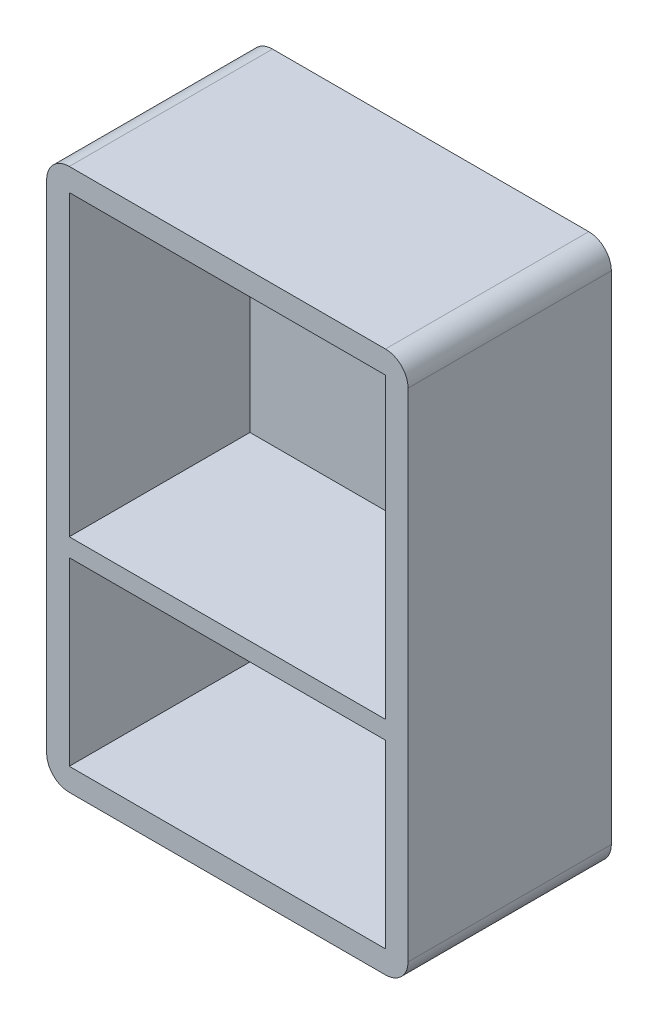
ISO-10303-21;
HEADER;
FILE_DESCRIPTION(('STEP AP214'),'2;1');
FILE_NAME('part.step','',(''),(''),'','','');
FILE_SCHEMA(('AUTOMOTIVE_DESIGN { 1 0 10303 214 1 1 1 1 }'));
ENDSEC;
DATA;
#1=APPLICATION_CONTEXT('core data for automotive mechanical design processes');
#2=APPLICATION_PROTOCOL_DEFINITION('international standard','automotive_design',2000,#1);
#3=PRODUCT_CONTEXT('',#1,'mechanical');
#4=PRODUCT('Part','Part','',(#3));
#5=PRODUCT_RELATED_PRODUCT_CATEGORY('part','',(#4));
#6=PRODUCT_DEFINITION_FORMATION('','',#4);
#7=PRODUCT_DEFINITION_CONTEXT('part definition',#1,'design');
#8=PRODUCT_DEFINITION('design','',#6,#7);
#9=PRODUCT_DEFINITION_SHAPE('','',#8);
#10=(LENGTH_UNIT() NAMED_UNIT(*) SI_UNIT(.MILLI.,.METRE.));
#11=(NAMED_UNIT(*) PLANE_ANGLE_UNIT() SI_UNIT($,.RADIAN.));
#12=(NAMED_UNIT(*) SI_UNIT($,.STERADIAN.) SOLID_ANGLE_UNIT());
#13=UNCERTAINTY_MEASURE_WITH_UNIT(LENGTH_MEASURE(1.E-05),#10,'distance_accuracy_value','');
#14=(GEOMETRIC_REPRESENTATION_CONTEXT(3) GLOBAL_UNCERTAINTY_ASSIGNED_CONTEXT((#13)) GLOBAL_UNIT_ASSIGNED_CONTEXT((#10,
#11,#12)) REPRESENTATION_CONTEXT('',''));
#15=CARTESIAN_POINT('',(0.,0.,0.));
#16=DIRECTION('',(0.,0.,1.));
#17=DIRECTION('',(1.,0.,0.));
#18=AXIS2_PLACEMENT_3D('',#15,#16,#17);
#19=CARTESIAN_POINT('',(40.,60.,5.));
#20=DIRECTION('',(-1.,0.,0.));
#21=DIRECTION('',(0.,-1.,0.));
#22=AXIS2_PLACEMENT_3D('',#19,#20,#21);
#23=PLANE('',#22);
#24=DIRECTION('',(0.,1.,0.));
#25=VECTOR('',#24,1.);
#26=CARTESIAN_POINT('',(40.,-60.,45.));
#27=LINE('',#26,#25);
#28=CARTESIAN_POINT('',(40.,-55.,45.));
#29=VERTEX_POINT('',#28);
#30=CARTESIAN_POINT('',(40.,55.,45.));
#31=VERTEX_POINT('',#30);
#32=EDGE_CURVE('E219',#29,#31,#27,.T.);
#33=ORIENTED_EDGE('',*,*,#32,.F.);
#34=DIRECTION('',(0.,0.,-1.));
#35=VECTOR('',#34,1.);
#36=CARTESIAN_POINT('',(40.,-55.,5.));
#37=LINE('',#36,#35);
#38=CARTESIAN_POINT('',(40.,-55.,0.));
#39=VERTEX_POINT('',#38);
#40=EDGE_CURVE('E267',#29,#39,#37,.T.);
#41=ORIENTED_EDGE('',*,*,#40,.T.);
#42=DIRECTION('',(0.,1.,0.));
#43=VECTOR('',#42,1.);
#44=CARTESIAN_POINT('',(40.,60.,0.));
#45=LINE('',#44,#43);
#46=CARTESIAN_POINT('',(40.,55.,0.));
#47=VERTEX_POINT('',#46);
#48=EDGE_CURVE('E229',#39,#47,#45,.T.);
#49=ORIENTED_EDGE('',*,*,#48,.T.);
#50=DIRECTION('',(0.,0.,-1.));
#51=VECTOR('',#50,1.);
#52=CARTESIAN_POINT('',(40.,55.,5.));
#53=LINE('',#52,#51);
#54=EDGE_CURVE('E265',#47,#31,#53,.F.);
#55=ORIENTED_EDGE('',*,*,#54,.T.);
#56=EDGE_LOOP('',(#33,#41,#49,#55));
#57=FACE_BOUND('',#56,.T.);
#58=ADVANCED_FACE('F34',(#57),#23,.F.);
#59=CARTESIAN_POINT('',(-40.,60.,5.));
#60=DIRECTION('',(0.,-1.,0.));
#61=DIRECTION('',(0.,0.,-1.));
#62=AXIS2_PLACEMENT_3D('',#59,#60,#61);
#63=PLANE('',#62);
#64=DIRECTION('',(-1.,0.,0.));
#65=VECTOR('',#64,1.);
#66=CARTESIAN_POINT('',(-40.,60.,45.));
#67=LINE('',#66,#65);
#68=CARTESIAN_POINT('',(35.,60.,45.));
#69=VERTEX_POINT('',#68);
#70=CARTESIAN_POINT('',(-35.,60.,45.));
#71=VERTEX_POINT('',#70);
#72=EDGE_CURVE('E221',#69,#71,#67,.T.);
#73=ORIENTED_EDGE('',*,*,#72,.F.);
#74=DIRECTION('',(0.,0.,-1.));
#75=VECTOR('',#74,1.);
#76=CARTESIAN_POINT('',(35.,60.,5.));
#77=LINE('',#76,#75);
#78=CARTESIAN_POINT('',(35.,60.,0.));
#79=VERTEX_POINT('',#78);
#80=EDGE_CURVE('E11',#69,#79,#77,.T.);
#81=ORIENTED_EDGE('',*,*,#80,.T.);
#82=DIRECTION('',(-1.,0.,0.));
#83=VECTOR('',#82,1.);
#84=CARTESIAN_POINT('',(-40.,60.,0.));
#85=LINE('',#84,#83);
#86=CARTESIAN_POINT('',(-35.,60.,0.));
#87=VERTEX_POINT('',#86);
#88=EDGE_CURVE('E232',#79,#87,#85,.T.);
#89=ORIENTED_EDGE('',*,*,#88,.T.);
#90=DIRECTION('',(0.,0.,-1.));
#91=VECTOR('',#90,1.);
#92=CARTESIAN_POINT('',(-35.,60.,5.));
#93=LINE('',#92,#91);
#94=EDGE_CURVE('E42',#87,#71,#93,.F.);
#95=ORIENTED_EDGE('',*,*,#94,.T.);
#96=EDGE_LOOP('',(#73,#81,#89,#95));
#97=FACE_BOUND('',#96,.T.);
#98=ADVANCED_FACE('F283',(#97),#63,.F.);
#99=CARTESIAN_POINT('',(-40.,60.,5.));
#100=DIRECTION('',(1.,0.,0.));
#101=DIRECTION('',(0.,1.,0.));
#102=AXIS2_PLACEMENT_3D('',#99,#100,#101);
#103=PLANE('',#102);
#104=DIRECTION('',(0.,-1.,0.));
#105=VECTOR('',#104,1.);
#106=CARTESIAN_POINT('',(-40.,60.,0.));
#107=LINE('',#106,#105);
#108=CARTESIAN_POINT('',(-40.,55.,0.));
#109=VERTEX_POINT('',#108);
#110=CARTESIAN_POINT('',(-40.,-55.,0.));
#111=VERTEX_POINT('',#110);
#112=EDGE_CURVE('E234',#109,#111,#107,.T.);
#113=ORIENTED_EDGE('',*,*,#112,.T.);
#114=DIRECTION('',(0.,0.,-1.));
#115=VECTOR('',#114,1.);
#116=CARTESIAN_POINT('',(-40.,-55.,5.));
#117=LINE('',#116,#115);
#118=CARTESIAN_POINT('',(-40.,-55.,45.));
#119=VERTEX_POINT('',#118);
#120=EDGE_CURVE('E256',#111,#119,#117,.F.);
#121=ORIENTED_EDGE('',*,*,#120,.T.);
#122=DIRECTION('',(0.,-1.,0.));
#123=VECTOR('',#122,1.);
#124=CARTESIAN_POINT('',(-40.,-60.,45.));
#125=LINE('',#124,#123);
#126=CARTESIAN_POINT('',(-40.,55.,45.));
#127=VERTEX_POINT('',#126);
#128=EDGE_CURVE('E223',#127,#119,#125,.T.);
#129=ORIENTED_EDGE('',*,*,#128,.F.);
#130=DIRECTION('',(0.,0.,-1.));
#131=VECTOR('',#130,1.);
#132=CARTESIAN_POINT('',(-40.,55.,5.));
#133=LINE('',#132,#131);
#134=EDGE_CURVE('E253',#127,#109,#133,.T.);
#135=ORIENTED_EDGE('',*,*,#134,.T.);
#136=EDGE_LOOP('',(#113,#121,#129,#135));
#137=FACE_BOUND('',#136,.T.);
#138=ADVANCED_FACE('F290',(#137),#103,.F.);
#139=CARTESIAN_POINT('',(-40.,-60.,5.));
#140=DIRECTION('',(0.,1.,0.));
#141=DIRECTION('',(0.,0.,1.));
#142=AXIS2_PLACEMENT_3D('',#139,#140,#141);
#143=PLANE('',#142);
#144=DIRECTION('',(1.,0.,0.));
#145=VECTOR('',#144,1.);
#146=CARTESIAN_POINT('',(-40.,-60.,45.));
#147=LINE('',#146,#145);
#148=CARTESIAN_POINT('',(-35.,-60.,45.));
#149=VERTEX_POINT('',#148);
#150=CARTESIAN_POINT('',(35.,-60.,45.));
#151=VERTEX_POINT('',#150);
#152=EDGE_CURVE('E226',#149,#151,#147,.T.);
#153=ORIENTED_EDGE('',*,*,#152,.F.);
#154=DIRECTION('',(0.,0.,-1.));
#155=VECTOR('',#154,1.);
#156=CARTESIAN_POINT('',(-35.,-60.,5.));
#157=LINE('',#156,#155);
#158=CARTESIAN_POINT('',(-35.,-60.,0.));
#159=VERTEX_POINT('',#158);
#160=EDGE_CURVE('E242',#149,#159,#157,.T.);
#161=ORIENTED_EDGE('',*,*,#160,.T.);
#162=DIRECTION('',(1.,0.,0.));
#163=VECTOR('',#162,1.);
#164=CARTESIAN_POINT('',(-40.,-60.,0.));
#165=LINE('',#164,#163);
#166=CARTESIAN_POINT('',(35.,-60.,0.));
#167=VERTEX_POINT('',#166);
#168=EDGE_CURVE('E237',#159,#167,#165,.T.);
#169=ORIENTED_EDGE('',*,*,#168,.T.);
#170=DIRECTION('',(0.,0.,-1.));
#171=VECTOR('',#170,1.);
#172=CARTESIAN_POINT('',(35.,-60.,5.));
#173=LINE('',#172,#171);
#174=EDGE_CURVE('E240',#167,#151,#173,.F.);
#175=ORIENTED_EDGE('',*,*,#174,.T.);
#176=EDGE_LOOP('',(#153,#161,#169,#175));
#177=FACE_BOUND('',#176,.T.);
#178=ADVANCED_FACE('F298',(#177),#143,.F.);
#179=CARTESIAN_POINT('',(0.,0.,0.));
#180=DIRECTION('',(0.,0.,1.));
#181=DIRECTION('',(1.,0.,0.));
#182=AXIS2_PLACEMENT_3D('',#179,#180,#181);
#183=PLANE('',#182);
#184=ORIENTED_EDGE('',*,*,#168,.F.);
#185=CARTESIAN_POINT('',(-35.,-55.,0.));
#186=DIRECTION('',(0.,0.,1.));
#187=DIRECTION('',(1.,0.,0.));
#188=AXIS2_PLACEMENT_3D('',#185,#186,#187);
#189=CIRCLE('',#188,5.);
#190=EDGE_CURVE('E251',#159,#111,#189,.F.);
#191=ORIENTED_EDGE('',*,*,#190,.T.);
#192=ORIENTED_EDGE('',*,*,#112,.F.);
#193=CARTESIAN_POINT('',(-35.,55.,0.));
#194=DIRECTION('',(0.,0.,1.));
#195=DIRECTION('',(1.,0.,0.));
#196=AXIS2_PLACEMENT_3D('',#193,#194,#195);
#197=CIRCLE('',#196,5.);
#198=EDGE_CURVE('E245',#109,#87,#197,.F.);
#199=ORIENTED_EDGE('',*,*,#198,.T.);
#200=ORIENTED_EDGE('',*,*,#88,.F.);
#201=CARTESIAN_POINT('',(35.,55.,0.));
#202=DIRECTION('',(0.,0.,1.));
#203=DIRECTION('',(1.,0.,0.));
#204=AXIS2_PLACEMENT_3D('',#201,#202,#203);
#205=CIRCLE('',#204,5.);
#206=EDGE_CURVE('E247',#79,#47,#205,.F.);
#207=ORIENTED_EDGE('',*,*,#206,.T.);
#208=ORIENTED_EDGE('',*,*,#48,.F.);
#209=CARTESIAN_POINT('',(35.,-55.,0.));
#210=DIRECTION('',(0.,0.,1.));
#211=DIRECTION('',(1.,0.,0.));
#212=AXIS2_PLACEMENT_3D('',#209,#210,#211);
#213=CIRCLE('',#212,5.);
#214=EDGE_CURVE('E249',#39,#167,#213,.F.);
#215=ORIENTED_EDGE('',*,*,#214,.T.);
#216=EDGE_LOOP('',(#184,#191,#192,#199,#200,#207,#208,#215));
#217=FACE_BOUND('',#216,.T.);
#218=ADVANCED_FACE('F278',(#217),#183,.F.);
#219=CARTESIAN_POINT('',(0.,0.,45.));
#220=DIRECTION('',(0.,0.,-1.));
#221=DIRECTION('',(-1.,0.,0.));
#222=AXIS2_PLACEMENT_3D('',#219,#220,#221);
#223=PLANE('',#222);
#224=DIRECTION('',(0.,1.,0.));
#225=VECTOR('',#224,1.);
#226=CARTESIAN_POINT('',(35.,55.,45.));
#227=LINE('',#226,#225);
#228=CARTESIAN_POINT('',(35.,-11.,45.));
#229=VERTEX_POINT('',#228);
#230=CARTESIAN_POINT('',(35.,55.,45.));
#231=VERTEX_POINT('',#230);
#232=EDGE_CURVE('E191',#229,#231,#227,.T.);
#233=ORIENTED_EDGE('',*,*,#232,.F.);
#234=DIRECTION('',(1.,0.,0.));
#235=VECTOR('',#234,1.);
#236=CARTESIAN_POINT('',(-35.,-11.,45.));
#237=LINE('',#236,#235);
#238=CARTESIAN_POINT('',(-35.,-11.,45.));
#239=VERTEX_POINT('',#238);
#240=EDGE_CURVE('E199',#239,#229,#237,.T.);
#241=ORIENTED_EDGE('',*,*,#240,.F.);
#242=DIRECTION('',(0.,-1.,0.));
#243=VECTOR('',#242,1.);
#244=CARTESIAN_POINT('',(-35.,55.,45.));
#245=LINE('',#244,#243);
#246=CARTESIAN_POINT('',(-35.,55.,45.));
#247=VERTEX_POINT('',#246);
#248=EDGE_CURVE('E196',#247,#239,#245,.T.);
#249=ORIENTED_EDGE('',*,*,#248,.F.);
#250=DIRECTION('',(-1.,0.,0.));
#251=VECTOR('',#250,1.);
#252=CARTESIAN_POINT('',(-35.,55.,45.));
#253=LINE('',#252,#251);
#254=EDGE_CURVE('E193',#231,#247,#253,.T.);
#255=ORIENTED_EDGE('',*,*,#254,.F.);
#256=EDGE_LOOP('',(#233,#241,#249,#255));
#257=FACE_BOUND('',#256,.T.);
#258=ORIENTED_EDGE('',*,*,#128,.T.);
#259=CARTESIAN_POINT('',(-35.,-55.,45.));
#260=DIRECTION('',(0.,0.,-1.));
#261=DIRECTION('',(-1.,0.,0.));
#262=AXIS2_PLACEMENT_3D('',#259,#260,#261);
#263=CIRCLE('',#262,5.);
#264=EDGE_CURVE('E263',#119,#149,#263,.F.);
#265=ORIENTED_EDGE('',*,*,#264,.T.);
#266=ORIENTED_EDGE('',*,*,#152,.T.);
#267=CARTESIAN_POINT('',(35.,-55.,45.));
#268=DIRECTION('',(0.,0.,-1.));
#269=DIRECTION('',(-1.,0.,0.));
#270=AXIS2_PLACEMENT_3D('',#267,#268,#269);
#271=CIRCLE('',#270,5.);
#272=EDGE_CURVE('E261',#151,#29,#271,.F.);
#273=ORIENTED_EDGE('',*,*,#272,.T.);
#274=ORIENTED_EDGE('',*,*,#32,.T.);
#275=CARTESIAN_POINT('',(35.,55.,45.));
#276=DIRECTION('',(0.,0.,-1.));
#277=DIRECTION('',(-1.,0.,0.));
#278=AXIS2_PLACEMENT_3D('',#275,#276,#277);
#279=CIRCLE('',#278,5.);
#280=EDGE_CURVE('E55',#31,#69,#279,.F.);
#281=ORIENTED_EDGE('',*,*,#280,.T.);
#282=ORIENTED_EDGE('',*,*,#72,.T.);
#283=CARTESIAN_POINT('',(-35.,55.,45.));
#284=DIRECTION('',(0.,0.,-1.));
#285=DIRECTION('',(-1.,0.,0.));
#286=AXIS2_PLACEMENT_3D('',#283,#284,#285);
#287=CIRCLE('',#286,5.);
#288=EDGE_CURVE('E258',#71,#127,#287,.F.);
#289=ORIENTED_EDGE('',*,*,#288,.T.);
#290=EDGE_LOOP('',(#258,#265,#266,#273,#274,#281,#282,#289));
#291=FACE_BOUND('',#290,.T.);
#292=DIRECTION('',(0.,1.,0.));
#293=VECTOR('',#292,1.);
#294=CARTESIAN_POINT('',(35.,-55.,45.));
#295=LINE('',#294,#293);
#296=CARTESIAN_POINT('',(35.,-55.,45.));
#297=VERTEX_POINT('',#296);
#298=CARTESIAN_POINT('',(35.,-15.,45.));
#299=VERTEX_POINT('',#298);
#300=EDGE_CURVE('E149',#297,#299,#295,.T.);
#301=ORIENTED_EDGE('',*,*,#300,.F.);
#302=DIRECTION('',(1.,0.,0.));
#303=VECTOR('',#302,1.);
#304=CARTESIAN_POINT('',(-35.,-55.,45.));
#305=LINE('',#304,#303);
#306=CARTESIAN_POINT('',(-35.,-55.,45.));
#307=VERTEX_POINT('',#306);
#308=EDGE_CURVE('E176',#307,#297,#305,.T.);
#309=ORIENTED_EDGE('',*,*,#308,.F.);
#310=DIRECTION('',(0.,-1.,0.));
#311=VECTOR('',#310,1.);
#312=CARTESIAN_POINT('',(-35.,-55.,45.));
#313=LINE('',#312,#311);
#314=CARTESIAN_POINT('',(-35.,-15.,45.));
#315=VERTEX_POINT('',#314);
#316=EDGE_CURVE('E174',#315,#307,#313,.T.);
#317=ORIENTED_EDGE('',*,*,#316,.F.);
#318=DIRECTION('',(-1.,0.,0.));
#319=VECTOR('',#318,1.);
#320=CARTESIAN_POINT('',(-35.,-15.,45.));
#321=LINE('',#320,#319);
#322=EDGE_CURVE('E159',#299,#315,#321,.T.);
#323=ORIENTED_EDGE('',*,*,#322,.F.);
#324=EDGE_LOOP('',(#301,#309,#317,#323));
#325=FACE_BOUND('',#324,.T.);
#326=ADVANCED_FACE('F172',(#257,#291,#325),#223,.F.);
#327=CARTESIAN_POINT('',(35.,55.,45.));
#328=DIRECTION('',(-1.,0.,0.));
#329=DIRECTION('',(0.,-1.,0.));
#330=AXIS2_PLACEMENT_3D('',#327,#328,#329);
#331=PLANE('',#330);
#332=DIRECTION('',(0.,1.,0.));
#333=VECTOR('',#332,1.);
#334=CARTESIAN_POINT('',(35.,55.,5.));
#335=LINE('',#334,#333);
#336=CARTESIAN_POINT('',(35.,-11.,5.));
#337=VERTEX_POINT('',#336);
#338=CARTESIAN_POINT('',(35.,55.,5.));
#339=VERTEX_POINT('',#338);
#340=EDGE_CURVE('E168',#337,#339,#335,.T.);
#341=ORIENTED_EDGE('',*,*,#340,.F.);
#342=DIRECTION('',(0.,0.,-1.));
#343=VECTOR('',#342,1.);
#344=CARTESIAN_POINT('',(35.,-11.,45.));
#345=LINE('',#344,#343);
#346=EDGE_CURVE('E201',#229,#337,#345,.T.);
#347=ORIENTED_EDGE('',*,*,#346,.F.);
#348=ORIENTED_EDGE('',*,*,#232,.T.);
#349=DIRECTION('',(0.,0.,-1.));
#350=VECTOR('',#349,1.);
#351=CARTESIAN_POINT('',(35.,55.,45.));
#352=LINE('',#351,#350);
#353=EDGE_CURVE('E216',#231,#339,#352,.T.);
#354=ORIENTED_EDGE('',*,*,#353,.T.);
#355=EDGE_LOOP('',(#341,#347,#348,#354));
#356=FACE_BOUND('',#355,.T.);
#357=ADVANCED_FACE('F329',(#356),#331,.T.);
#358=CARTESIAN_POINT('',(-35.,55.,45.));
#359=DIRECTION('',(0.,-1.,0.));
#360=DIRECTION('',(0.,0.,-1.));
#361=AXIS2_PLACEMENT_3D('',#358,#359,#360);
#362=PLANE('',#361);
#363=DIRECTION('',(-1.,0.,0.));
#364=VECTOR('',#363,1.);
#365=CARTESIAN_POINT('',(-35.,55.,5.));
#366=LINE('',#365,#364);
#367=CARTESIAN_POINT('',(-35.,55.,5.));
#368=VERTEX_POINT('',#367);
#369=EDGE_CURVE('E203',#339,#368,#366,.T.);
#370=ORIENTED_EDGE('',*,*,#369,.F.);
#371=ORIENTED_EDGE('',*,*,#353,.F.);
#372=ORIENTED_EDGE('',*,*,#254,.T.);
#373=DIRECTION('',(0.,0.,-1.));
#374=VECTOR('',#373,1.);
#375=CARTESIAN_POINT('',(-35.,55.,45.));
#376=LINE('',#375,#374);
#377=EDGE_CURVE('E213',#247,#368,#376,.T.);
#378=ORIENTED_EDGE('',*,*,#377,.T.);
#379=EDGE_LOOP('',(#370,#371,#372,#378));
#380=FACE_BOUND('',#379,.T.);
#381=ADVANCED_FACE('F333',(#380),#362,.T.);
#382=CARTESIAN_POINT('',(-35.,55.,45.));
#383=DIRECTION('',(1.,0.,0.));
#384=DIRECTION('',(0.,1.,0.));
#385=AXIS2_PLACEMENT_3D('',#382,#383,#384);
#386=PLANE('',#385);
#387=DIRECTION('',(0.,-1.,0.));
#388=VECTOR('',#387,1.);
#389=CARTESIAN_POINT('',(-35.,55.,5.));
#390=LINE('',#389,#388);
#391=CARTESIAN_POINT('',(-35.,-11.,5.));
#392=VERTEX_POINT('',#391);
#393=EDGE_CURVE('E205',#368,#392,#390,.T.);
#394=ORIENTED_EDGE('',*,*,#393,.F.);
#395=ORIENTED_EDGE('',*,*,#377,.F.);
#396=ORIENTED_EDGE('',*,*,#248,.T.);
#397=DIRECTION('',(0.,0.,-1.));
#398=VECTOR('',#397,1.);
#399=CARTESIAN_POINT('',(-35.,-11.,45.));
#400=LINE('',#399,#398);
#401=EDGE_CURVE('E210',#239,#392,#400,.T.);
#402=ORIENTED_EDGE('',*,*,#401,.T.);
#403=EDGE_LOOP('',(#394,#395,#396,#402));
#404=FACE_BOUND('',#403,.T.);
#405=ADVANCED_FACE('F337',(#404),#386,.T.);
#406=CARTESIAN_POINT('',(-35.,-11.,45.));
#407=DIRECTION('',(0.,1.,0.));
#408=DIRECTION('',(0.,0.,1.));
#409=AXIS2_PLACEMENT_3D('',#406,#407,#408);
#410=PLANE('',#409);
#411=DIRECTION('',(1.,0.,0.));
#412=VECTOR('',#411,1.);
#413=CARTESIAN_POINT('',(-35.,-11.,5.));
#414=LINE('',#413,#412);
#415=EDGE_CURVE('E194',#392,#337,#414,.T.);
#416=ORIENTED_EDGE('',*,*,#415,.F.);
#417=ORIENTED_EDGE('',*,*,#401,.F.);
#418=ORIENTED_EDGE('',*,*,#240,.T.);
#419=ORIENTED_EDGE('',*,*,#346,.T.);
#420=EDGE_LOOP('',(#416,#417,#418,#419));
#421=FACE_BOUND('',#420,.T.);
#422=ADVANCED_FACE('F341',(#421),#410,.T.);
#423=CARTESIAN_POINT('',(35.,-55.,45.));
#424=DIRECTION('',(-1.,0.,0.));
#425=DIRECTION('',(0.,0.,1.));
#426=AXIS2_PLACEMENT_3D('',#423,#424,#425);
#427=PLANE('',#426);
#428=DIRECTION('',(0.,1.,0.));
#429=VECTOR('',#428,1.);
#430=CARTESIAN_POINT('',(35.,-55.,5.));
#431=LINE('',#430,#429);
#432=CARTESIAN_POINT('',(35.,-55.,5.));
#433=VERTEX_POINT('',#432);
#434=CARTESIAN_POINT('',(35.,-15.,5.));
#435=VERTEX_POINT('',#434);
#436=EDGE_CURVE('E180',#433,#435,#431,.T.);
#437=ORIENTED_EDGE('',*,*,#436,.F.);
#438=DIRECTION('',(0.,0.,-1.));
#439=VECTOR('',#438,1.);
#440=CARTESIAN_POINT('',(35.,-55.,45.));
#441=LINE('',#440,#439);
#442=EDGE_CURVE('E155',#297,#433,#441,.T.);
#443=ORIENTED_EDGE('',*,*,#442,.F.);
#444=ORIENTED_EDGE('',*,*,#300,.T.);
#445=DIRECTION('',(0.,0.,-1.));
#446=VECTOR('',#445,1.);
#447=CARTESIAN_POINT('',(35.,-15.,45.));
#448=LINE('',#447,#446);
#449=EDGE_CURVE('E153',#299,#435,#448,.T.);
#450=ORIENTED_EDGE('',*,*,#449,.T.);
#451=EDGE_LOOP('',(#437,#443,#444,#450));
#452=FACE_BOUND('',#451,.T.);
#453=ADVANCED_FACE('F152',(#452),#427,.T.);
#454=CARTESIAN_POINT('',(-35.,-15.,45.));
#455=DIRECTION('',(0.,-1.,0.));
#456=DIRECTION('',(0.,0.,-1.));
#457=AXIS2_PLACEMENT_3D('',#454,#455,#456);
#458=PLANE('',#457);
#459=DIRECTION('',(-1.,0.,0.));
#460=VECTOR('',#459,1.);
#461=CARTESIAN_POINT('',(-35.,-15.,5.));
#462=LINE('',#461,#460);
#463=CARTESIAN_POINT('',(-35.,-15.,5.));
#464=VERTEX_POINT('',#463);
#465=EDGE_CURVE('E167',#435,#464,#462,.T.);
#466=ORIENTED_EDGE('',*,*,#465,.F.);
#467=ORIENTED_EDGE('',*,*,#449,.F.);
#468=ORIENTED_EDGE('',*,*,#322,.T.);
#469=DIRECTION('',(0.,0.,-1.));
#470=VECTOR('',#469,1.);
#471=CARTESIAN_POINT('',(-35.,-15.,45.));
#472=LINE('',#471,#470);
#473=EDGE_CURVE('E169',#315,#464,#472,.T.);
#474=ORIENTED_EDGE('',*,*,#473,.T.);
#475=EDGE_LOOP('',(#466,#467,#468,#474));
#476=FACE_BOUND('',#475,.T.);
#477=ADVANCED_FACE('F164',(#476),#458,.T.);
#478=CARTESIAN_POINT('',(-35.,-55.,45.));
#479=DIRECTION('',(1.,0.,0.));
#480=DIRECTION('',(0.,0.,-1.));
#481=AXIS2_PLACEMENT_3D('',#478,#479,#480);
#482=PLANE('',#481);
#483=DIRECTION('',(0.,-1.,0.));
#484=VECTOR('',#483,1.);
#485=CARTESIAN_POINT('',(-35.,-55.,5.));
#486=LINE('',#485,#484);
#487=CARTESIAN_POINT('',(-35.,-55.,5.));
#488=VERTEX_POINT('',#487);
#489=EDGE_CURVE('E183',#464,#488,#486,.T.);
#490=ORIENTED_EDGE('',*,*,#489,.F.);
#491=ORIENTED_EDGE('',*,*,#473,.F.);
#492=ORIENTED_EDGE('',*,*,#316,.T.);
#493=DIRECTION('',(0.,0.,-1.));
#494=VECTOR('',#493,1.);
#495=CARTESIAN_POINT('',(-35.,-55.,45.));
#496=LINE('',#495,#494);
#497=EDGE_CURVE('E187',#307,#488,#496,.T.);
#498=ORIENTED_EDGE('',*,*,#497,.T.);
#499=EDGE_LOOP('',(#490,#491,#492,#498));
#500=FACE_BOUND('',#499,.T.);
#501=ADVANCED_FACE('F350',(#500),#482,.T.);
#502=CARTESIAN_POINT('',(-35.,-55.,45.));
#503=DIRECTION('',(0.,1.,0.));
#504=DIRECTION('',(0.,0.,1.));
#505=AXIS2_PLACEMENT_3D('',#502,#503,#504);
#506=PLANE('',#505);
#507=DIRECTION('',(1.,0.,0.));
#508=VECTOR('',#507,1.);
#509=CARTESIAN_POINT('',(-35.,-55.,5.));
#510=LINE('',#509,#508);
#511=EDGE_CURVE('E160',#488,#433,#510,.T.);
#512=ORIENTED_EDGE('',*,*,#511,.F.);
#513=ORIENTED_EDGE('',*,*,#497,.F.);
#514=ORIENTED_EDGE('',*,*,#308,.T.);
#515=ORIENTED_EDGE('',*,*,#442,.T.);
#516=EDGE_LOOP('',(#512,#513,#514,#515));
#517=FACE_BOUND('',#516,.T.);
#518=ADVANCED_FACE('F325',(#517),#506,.T.);
#519=CARTESIAN_POINT('',(0.,0.,5.));
#520=DIRECTION('',(0.,0.,1.));
#521=DIRECTION('',(1.,0.,0.));
#522=AXIS2_PLACEMENT_3D('',#519,#520,#521);
#523=PLANE('',#522);
#524=ORIENTED_EDGE('',*,*,#436,.T.);
#525=ORIENTED_EDGE('',*,*,#465,.T.);
#526=ORIENTED_EDGE('',*,*,#489,.T.);
#527=ORIENTED_EDGE('',*,*,#511,.T.);
#528=EDGE_LOOP('',(#524,#525,#526,#527));
#529=FACE_BOUND('',#528,.T.);
#530=ADVANCED_FACE('F322',(#529),#523,.T.);
#531=ORIENTED_EDGE('',*,*,#340,.T.);
#532=ORIENTED_EDGE('',*,*,#369,.T.);
#533=ORIENTED_EDGE('',*,*,#393,.T.);
#534=ORIENTED_EDGE('',*,*,#415,.T.);
#535=EDGE_LOOP('',(#531,#532,#533,#534));
#536=FACE_BOUND('',#535,.T.);
#537=ADVANCED_FACE('F307',(#536),#523,.T.);
#538=CARTESIAN_POINT('',(-35.,-55.,5.));
#539=DIRECTION('',(0.,0.,-1.));
#540=DIRECTION('',(-1.,0.,0.));
#541=AXIS2_PLACEMENT_3D('',#538,#539,#540);
#542=CYLINDRICAL_SURFACE('',#541,5.);
#543=ORIENTED_EDGE('',*,*,#264,.F.);
#544=ORIENTED_EDGE('',*,*,#120,.F.);
#545=ORIENTED_EDGE('',*,*,#190,.F.);
#546=ORIENTED_EDGE('',*,*,#160,.F.);
#547=EDGE_LOOP('',(#543,#544,#545,#546));
#548=FACE_BOUND('',#547,.T.);
#549=ADVANCED_FACE('F295',(#548),#542,.T.);
#550=CARTESIAN_POINT('',(35.,-55.,5.));
#551=DIRECTION('',(0.,0.,-1.));
#552=DIRECTION('',(-1.,0.,0.));
#553=AXIS2_PLACEMENT_3D('',#550,#551,#552);
#554=CYLINDRICAL_SURFACE('',#553,5.);
#555=ORIENTED_EDGE('',*,*,#272,.F.);
#556=ORIENTED_EDGE('',*,*,#174,.F.);
#557=ORIENTED_EDGE('',*,*,#214,.F.);
#558=ORIENTED_EDGE('',*,*,#40,.F.);
#559=EDGE_LOOP('',(#555,#556,#557,#558));
#560=FACE_BOUND('',#559,.T.);
#561=ADVANCED_FACE('F300',(#560),#554,.T.);
#562=CARTESIAN_POINT('',(35.,55.,5.));
#563=DIRECTION('',(0.,0.,-1.));
#564=DIRECTION('',(-1.,0.,0.));
#565=AXIS2_PLACEMENT_3D('',#562,#563,#564);
#566=CYLINDRICAL_SURFACE('',#565,5.);
#567=ORIENTED_EDGE('',*,*,#280,.F.);
#568=ORIENTED_EDGE('',*,*,#54,.F.);
#569=ORIENTED_EDGE('',*,*,#206,.F.);
#570=ORIENTED_EDGE('',*,*,#80,.F.);
#571=EDGE_LOOP('',(#567,#568,#569,#570));
#572=FACE_BOUND('',#571,.T.);
#573=ADVANCED_FACE('F282',(#572),#566,.T.);
#574=CARTESIAN_POINT('',(-35.,55.,5.));
#575=DIRECTION('',(0.,0.,-1.));
#576=DIRECTION('',(-1.,0.,0.));
#577=AXIS2_PLACEMENT_3D('',#574,#575,#576);
#578=CYLINDRICAL_SURFACE('',#577,5.);
#579=ORIENTED_EDGE('',*,*,#288,.F.);
#580=ORIENTED_EDGE('',*,*,#94,.F.);
#581=ORIENTED_EDGE('',*,*,#198,.F.);
#582=ORIENTED_EDGE('',*,*,#134,.F.);
#583=EDGE_LOOP('',(#579,#580,#581,#582));
#584=FACE_BOUND('',#583,.T.);
#585=ADVANCED_FACE('F36',(#584),#578,.T.);
#586=CLOSED_SHELL('',(#58,#98,#138,#178,#218,#326,#357,#381,#405,#422,#453,#477,#501,#518,#530,
#537,#549,#561,#573,#585));
#587=MANIFOLD_SOLID_BREP('B2',#586);
#588=ADVANCED_BREP_SHAPE_REPRESENTATION('',(#18,#587),#14);
#589=SHAPE_DEFINITION_REPRESENTATION(#9,#588);
ENDSEC;
END-ISO-10303-21;
